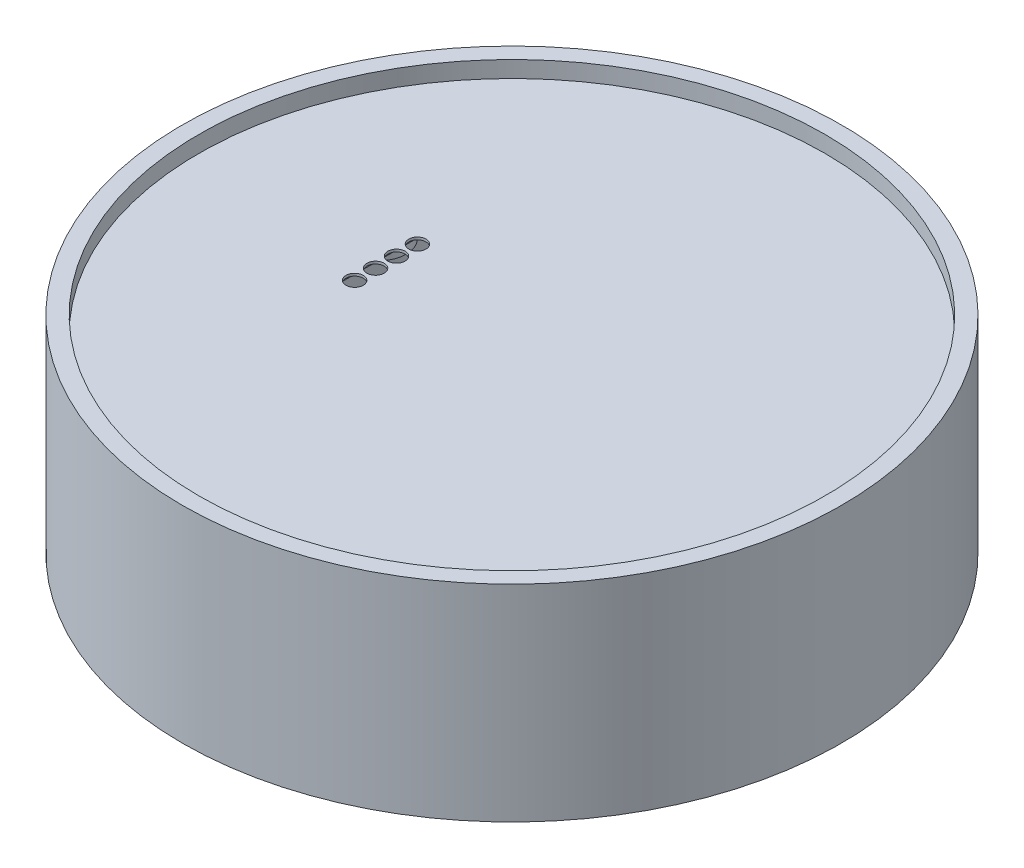
ISO-10303-21;
HEADER;
FILE_DESCRIPTION(('STEP AP214'),'2;1');
FILE_NAME('part.step','',(''),(''),'','','');
FILE_SCHEMA(('AUTOMOTIVE_DESIGN { 1 0 10303 214 1 1 1 1 }'));
ENDSEC;
DATA;
#1=APPLICATION_CONTEXT('core data for automotive mechanical design processes');
#2=APPLICATION_PROTOCOL_DEFINITION('international standard','automotive_design',2000,#1);
#3=PRODUCT_CONTEXT('',#1,'mechanical');
#4=PRODUCT('Part','Part','',(#3));
#5=PRODUCT_RELATED_PRODUCT_CATEGORY('part','',(#4));
#6=PRODUCT_DEFINITION_FORMATION('','',#4);
#7=PRODUCT_DEFINITION_CONTEXT('part definition',#1,'design');
#8=PRODUCT_DEFINITION('design','',#6,#7);
#9=PRODUCT_DEFINITION_SHAPE('','',#8);
#10=(LENGTH_UNIT() NAMED_UNIT(*) SI_UNIT(.MILLI.,.METRE.));
#11=(NAMED_UNIT(*) PLANE_ANGLE_UNIT() SI_UNIT($,.RADIAN.));
#12=(NAMED_UNIT(*) SI_UNIT($,.STERADIAN.) SOLID_ANGLE_UNIT());
#13=UNCERTAINTY_MEASURE_WITH_UNIT(LENGTH_MEASURE(1.E-05),#10,'distance_accuracy_value','');
#14=(GEOMETRIC_REPRESENTATION_CONTEXT(3) GLOBAL_UNCERTAINTY_ASSIGNED_CONTEXT((#13)) GLOBAL_UNIT_ASSIGNED_CONTEXT((#10,
#11,#12)) REPRESENTATION_CONTEXT('',''));
#15=CARTESIAN_POINT('',(0.,0.,0.));
#16=DIRECTION('',(0.,0.,1.));
#17=DIRECTION('',(1.,0.,0.));
#18=AXIS2_PLACEMENT_3D('',#15,#16,#17);
#19=CARTESIAN_POINT('',(0.,-25.,0.));
#20=DIRECTION('',(0.,1.,0.));
#21=DIRECTION('',(0.,0.,1.));
#22=AXIS2_PLACEMENT_3D('',#19,#20,#21);
#23=CYLINDRICAL_SURFACE('',#22,40.);
#24=CARTESIAN_POINT('',(0.,-19.7,0.));
#25=DIRECTION('',(0.,-1.,0.));
#26=DIRECTION('',(0.,0.,-1.));
#27=AXIS2_PLACEMENT_3D('',#24,#25,#26);
#28=CIRCLE('',#27,40.);
#29=CARTESIAN_POINT('',(-39.5087015731978,-19.7,-6.25));
#30=VERTEX_POINT('',#29);
#31=CARTESIAN_POINT('',(-39.5087015731978,-19.7,6.25));
#32=VERTEX_POINT('',#31);
#33=EDGE_CURVE('E164',#30,#32,#28,.F.);
#34=ORIENTED_EDGE('',*,*,#33,.F.);
#35=DIRECTION('',(0.,1.,0.));
#36=VECTOR('',#35,1.);
#37=CARTESIAN_POINT('',(-39.5087015731978,-25.,-6.25));
#38=LINE('',#37,#36);
#39=CARTESIAN_POINT('',(-39.5087015731978,-8.20000000000001,-6.25));
#40=VERTEX_POINT('',#39);
#41=EDGE_CURVE('E173',#40,#30,#38,.F.);
#42=ORIENTED_EDGE('',*,*,#41,.F.);
#43=CARTESIAN_POINT('',(0.,-8.20000000000001,0.));
#44=DIRECTION('',(0.,1.,0.));
#45=DIRECTION('',(0.,0.,1.));
#46=AXIS2_PLACEMENT_3D('',#43,#44,#45);
#47=CIRCLE('',#46,40.);
#48=CARTESIAN_POINT('',(-39.5087015731978,-8.20000000000001,6.25));
#49=VERTEX_POINT('',#48);
#50=EDGE_CURVE('E175',#49,#40,#47,.F.);
#51=ORIENTED_EDGE('',*,*,#50,.F.);
#52=DIRECTION('',(0.,1.,0.));
#53=VECTOR('',#52,1.);
#54=CARTESIAN_POINT('',(-39.5087015731978,-25.,6.25));
#55=LINE('',#54,#53);
#56=EDGE_CURVE('E177',#32,#49,#55,.T.);
#57=ORIENTED_EDGE('',*,*,#56,.F.);
#58=EDGE_LOOP('',(#34,#42,#51,#57));
#59=FACE_BOUND('',#58,.T.);
#60=CARTESIAN_POINT('',(0.,-25.,0.));
#61=DIRECTION('',(0.,1.,0.));
#62=DIRECTION('',(0.,0.,1.));
#63=AXIS2_PLACEMENT_3D('',#60,#61,#62);
#64=CIRCLE('',#63,40.);
#65=CARTESIAN_POINT('',(0.,-25.,40.));
#66=VERTEX_POINT('',#65);
#67=EDGE_CURVE('E192',#66,#66,#64,.T.);
#68=ORIENTED_EDGE('',*,*,#67,.T.);
#69=EDGE_LOOP('',(#68));
#70=FACE_BOUND('',#69,.T.);
#71=CARTESIAN_POINT('',(0.,0.,0.));
#72=DIRECTION('',(0.,1.,0.));
#73=DIRECTION('',(0.,0.,1.));
#74=AXIS2_PLACEMENT_3D('',#71,#72,#73);
#75=CIRCLE('',#74,40.);
#76=CARTESIAN_POINT('',(0.,0.,40.));
#77=VERTEX_POINT('',#76);
#78=EDGE_CURVE('E189',#77,#77,#75,.T.);
#79=ORIENTED_EDGE('',*,*,#78,.F.);
#80=EDGE_LOOP('',(#79));
#81=FACE_BOUND('',#80,.T.);
#82=ADVANCED_FACE('F35',(#59,#70,#81),#23,.T.);
#83=CARTESIAN_POINT('',(0.,-25.,0.));
#84=DIRECTION('',(0.,1.,0.));
#85=DIRECTION('',(0.,0.,1.));
#86=AXIS2_PLACEMENT_3D('',#83,#84,#85);
#87=PLANE('',#86);
#88=CARTESIAN_POINT('',(0.,-25.,0.));
#89=DIRECTION('',(0.,-1.,0.));
#90=DIRECTION('',(0.,0.,-1.));
#91=AXIS2_PLACEMENT_3D('',#88,#89,#90);
#92=CIRCLE('',#91,37.);
#93=CARTESIAN_POINT('',(0.,-25.,-37.));
#94=VERTEX_POINT('',#93);
#95=EDGE_CURVE('E179',#94,#94,#92,.T.);
#96=ORIENTED_EDGE('',*,*,#95,.F.);
#97=EDGE_LOOP('',(#96));
#98=FACE_BOUND('',#97,.T.);
#99=ORIENTED_EDGE('',*,*,#67,.F.);
#100=EDGE_LOOP('',(#99));
#101=FACE_BOUND('',#100,.T.);
#102=ADVANCED_FACE('F244',(#98,#101),#87,.F.);
#103=CARTESIAN_POINT('',(0.,0.,0.));
#104=DIRECTION('',(0.,1.,0.));
#105=DIRECTION('',(0.,0.,1.));
#106=AXIS2_PLACEMENT_3D('',#103,#104,#105);
#107=PLANE('',#106);
#108=CARTESIAN_POINT('',(0.,0.,0.));
#109=DIRECTION('',(0.,1.,0.));
#110=DIRECTION('',(0.,0.,1.));
#111=AXIS2_PLACEMENT_3D('',#108,#109,#110);
#112=CIRCLE('',#111,38.);
#113=CARTESIAN_POINT('',(0.,0.,38.));
#114=VERTEX_POINT('',#113);
#115=EDGE_CURVE('E185',#114,#114,#112,.T.);
#116=ORIENTED_EDGE('',*,*,#115,.F.);
#117=EDGE_LOOP('',(#116));
#118=FACE_BOUND('',#117,.T.);
#119=ORIENTED_EDGE('',*,*,#78,.T.);
#120=EDGE_LOOP('',(#119));
#121=FACE_BOUND('',#120,.T.);
#122=ADVANCED_FACE('F250',(#118,#121),#107,.T.);
#123=CARTESIAN_POINT('',(0.,-2.,0.));
#124=DIRECTION('',(0.,1.,0.));
#125=DIRECTION('',(0.,0.,1.));
#126=AXIS2_PLACEMENT_3D('',#123,#124,#125);
#127=CYLINDRICAL_SURFACE('',#126,38.);
#128=CARTESIAN_POINT('',(0.,-2.,0.));
#129=DIRECTION('',(0.,1.,0.));
#130=DIRECTION('',(0.,0.,1.));
#131=AXIS2_PLACEMENT_3D('',#128,#129,#130);
#132=CIRCLE('',#131,38.);
#133=CARTESIAN_POINT('',(0.,-2.,38.));
#134=VERTEX_POINT('',#133);
#135=EDGE_CURVE('E186',#134,#134,#132,.T.);
#136=ORIENTED_EDGE('',*,*,#135,.F.);
#137=EDGE_LOOP('',(#136));
#138=FACE_BOUND('',#137,.T.);
#139=ORIENTED_EDGE('',*,*,#115,.T.);
#140=EDGE_LOOP('',(#139));
#141=FACE_BOUND('',#140,.T.);
#142=ADVANCED_FACE('F354',(#138,#141),#127,.F.);
#143=CARTESIAN_POINT('',(0.,-2.,0.));
#144=DIRECTION('',(0.,1.,0.));
#145=DIRECTION('',(0.,0.,1.));
#146=AXIS2_PLACEMENT_3D('',#143,#144,#145);
#147=PLANE('',#146);
#148=CARTESIAN_POINT('',(-15.2035304330875,-2.,3.88729098877897));
#149=DIRECTION('',(0.,1.,0.));
#150=DIRECTION('',(0.,0.,1.));
#151=AXIS2_PLACEMENT_3D('',#148,#149,#150);
#152=CIRCLE('',#151,1.05);
#153=CARTESIAN_POINT('',(-15.2035304330875,-2.,4.93729098877897));
#154=VERTEX_POINT('',#153);
#155=EDGE_CURVE('E149',#154,#154,#152,.T.);
#156=ORIENTED_EDGE('',*,*,#155,.F.);
#157=EDGE_LOOP('',(#156));
#158=FACE_BOUND('',#157,.T.);
#159=CARTESIAN_POINT('',(-15.2035304330875,-2.,1.34729098877897));
#160=DIRECTION('',(0.,1.,0.));
#161=DIRECTION('',(0.,0.,1.));
#162=AXIS2_PLACEMENT_3D('',#159,#160,#161);
#163=CIRCLE('',#162,1.05);
#164=CARTESIAN_POINT('',(-15.2035304330875,-2.,2.39729098877897));
#165=VERTEX_POINT('',#164);
#166=EDGE_CURVE('E152',#165,#165,#163,.T.);
#167=ORIENTED_EDGE('',*,*,#166,.F.);
#168=EDGE_LOOP('',(#167));
#169=FACE_BOUND('',#168,.T.);
#170=CARTESIAN_POINT('',(-15.2035304330876,-2.,-1.19270901122103));
#171=DIRECTION('',(0.,1.,0.));
#172=DIRECTION('',(0.,0.,1.));
#173=AXIS2_PLACEMENT_3D('',#170,#171,#172);
#174=CIRCLE('',#173,1.05);
#175=CARTESIAN_POINT('',(-15.2035304330876,-2.,-0.142709011221032));
#176=VERTEX_POINT('',#175);
#177=EDGE_CURVE('E155',#176,#176,#174,.T.);
#178=ORIENTED_EDGE('',*,*,#177,.F.);
#179=EDGE_LOOP('',(#178));
#180=FACE_BOUND('',#179,.T.);
#181=CARTESIAN_POINT('',(-15.2035304330876,-2.,-3.73270901122103));
#182=DIRECTION('',(0.,1.,0.));
#183=DIRECTION('',(0.,0.,1.));
#184=AXIS2_PLACEMENT_3D('',#181,#182,#183);
#185=CIRCLE('',#184,1.05);
#186=CARTESIAN_POINT('',(-15.2035304330876,-2.,-2.68270901122103));
#187=VERTEX_POINT('',#186);
#188=EDGE_CURVE('E158',#187,#187,#185,.T.);
#189=ORIENTED_EDGE('',*,*,#188,.F.);
#190=EDGE_LOOP('',(#189));
#191=FACE_BOUND('',#190,.T.);
#192=ORIENTED_EDGE('',*,*,#135,.T.);
#193=EDGE_LOOP('',(#192));
#194=FACE_BOUND('',#193,.T.);
#195=ADVANCED_FACE('F350',(#158,#169,#180,#191,#194),#147,.T.);
#196=CARTESIAN_POINT('',(0.,-3.5,0.));
#197=DIRECTION('',(0.,1.,0.));
#198=DIRECTION('',(0.,0.,1.));
#199=AXIS2_PLACEMENT_3D('',#196,#197,#198);
#200=PLANE('',#199);
#201=CARTESIAN_POINT('',(0.,-3.5,0.));
#202=DIRECTION('',(0.,1.,0.));
#203=DIRECTION('',(0.,0.,1.));
#204=AXIS2_PLACEMENT_3D('',#201,#202,#203);
#205=CIRCLE('',#204,12.);
#206=CARTESIAN_POINT('',(0.,-3.5,12.));
#207=VERTEX_POINT('',#206);
#208=EDGE_CURVE('E12',#207,#207,#205,.T.);
#209=ORIENTED_EDGE('',*,*,#208,.T.);
#210=EDGE_LOOP('',(#209));
#211=FACE_BOUND('',#210,.T.);
#212=CARTESIAN_POINT('',(0.,-3.5,-25.));
#213=DIRECTION('',(0.,1.,0.));
#214=DIRECTION('',(0.,0.,1.));
#215=AXIS2_PLACEMENT_3D('',#212,#213,#214);
#216=CIRCLE('',#215,4.75);
#217=CARTESIAN_POINT('',(0.,-3.5,-20.25));
#218=VERTEX_POINT('',#217);
#219=EDGE_CURVE('E223',#218,#218,#216,.F.);
#220=ORIENTED_EDGE('',*,*,#219,.F.);
#221=EDGE_LOOP('',(#220));
#222=FACE_BOUND('',#221,.T.);
#223=CARTESIAN_POINT('',(0.,-3.5,25.));
#224=DIRECTION('',(0.,1.,0.));
#225=DIRECTION('',(0.,0.,1.));
#226=AXIS2_PLACEMENT_3D('',#223,#224,#225);
#227=CIRCLE('',#226,4.75);
#228=CARTESIAN_POINT('',(0.,-3.5,29.75));
#229=VERTEX_POINT('',#228);
#230=EDGE_CURVE('E220',#229,#229,#227,.F.);
#231=ORIENTED_EDGE('',*,*,#230,.F.);
#232=EDGE_LOOP('',(#231));
#233=FACE_BOUND('',#232,.T.);
#234=CARTESIAN_POINT('',(-22.1439810647103,-3.5,6.93819701810031));
#235=DIRECTION('',(0.,1.,0.));
#236=DIRECTION('',(0.,0.,1.));
#237=AXIS2_PLACEMENT_3D('',#234,#235,#236);
#238=CIRCLE('',#237,4.3);
#239=CARTESIAN_POINT('',(-22.1439810647103,-3.5,11.2381970181003));
#240=VERTEX_POINT('',#239);
#241=EDGE_CURVE('E217',#240,#240,#238,.T.);
#242=ORIENTED_EDGE('',*,*,#241,.T.);
#243=EDGE_LOOP('',(#242));
#244=FACE_BOUND('',#243,.T.);
#245=CARTESIAN_POINT('',(-22.4162086300096,-3.5,-6.28444624916386));
#246=DIRECTION('',(0.,1.,0.));
#247=DIRECTION('',(0.,0.,1.));
#248=AXIS2_PLACEMENT_3D('',#245,#246,#247);
#249=CIRCLE('',#248,3.3);
#250=CARTESIAN_POINT('',(-22.4162086300096,-3.5,-2.98444624916386));
#251=VERTEX_POINT('',#250);
#252=EDGE_CURVE('E209',#251,#251,#249,.F.);
#253=ORIENTED_EDGE('',*,*,#252,.F.);
#254=EDGE_LOOP('',(#253));
#255=FACE_BOUND('',#254,.T.);
#256=DIRECTION('',(0.,0.,-1.));
#257=VECTOR('',#256,1.);
#258=CARTESIAN_POINT('',(-17.3294977304524,-3.5,-7.79534910437546));
#259=LINE('',#258,#257);
#260=CARTESIAN_POINT('',(-17.3294977304524,-3.5,7.9499310819334));
#261=VERTEX_POINT('',#260);
#262=CARTESIAN_POINT('',(-17.3294977304524,-3.5,-7.79534910437546));
#263=VERTEX_POINT('',#262);
#264=EDGE_CURVE('E125',#261,#263,#259,.T.);
#265=ORIENTED_EDGE('',*,*,#264,.F.);
#266=DIRECTION('',(-1.,0.,0.));
#267=VECTOR('',#266,1.);
#268=CARTESIAN_POINT('',(-17.3294977304524,-3.5,7.9499310819334));
#269=LINE('',#268,#267);
#270=CARTESIAN_POINT('',(-13.0775631357227,-3.5,7.9499310819334));
#271=VERTEX_POINT('',#270);
#272=EDGE_CURVE('E117',#271,#261,#269,.T.);
#273=ORIENTED_EDGE('',*,*,#272,.F.);
#274=DIRECTION('',(0.,0.,1.));
#275=VECTOR('',#274,1.);
#276=CARTESIAN_POINT('',(-13.0775631357227,-3.5,-7.79534910437546));
#277=LINE('',#276,#275);
#278=CARTESIAN_POINT('',(-13.0775631357227,-3.5,-7.79534910437546));
#279=VERTEX_POINT('',#278);
#280=EDGE_CURVE('E129',#279,#271,#277,.T.);
#281=ORIENTED_EDGE('',*,*,#280,.F.);
#282=DIRECTION('',(1.,0.,0.));
#283=VECTOR('',#282,1.);
#284=CARTESIAN_POINT('',(-17.3294977304524,-3.5,-7.79534910437546));
#285=LINE('',#284,#283);
#286=EDGE_CURVE('E50',#263,#279,#285,.T.);
#287=ORIENTED_EDGE('',*,*,#286,.F.);
#288=EDGE_LOOP('',(#265,#273,#281,#287));
#289=FACE_BOUND('',#288,.T.);
#290=CARTESIAN_POINT('',(0.,-3.5,0.));
#291=DIRECTION('',(0.,1.,0.));
#292=DIRECTION('',(0.,0.,1.));
#293=AXIS2_PLACEMENT_3D('',#290,#291,#292);
#294=CIRCLE('',#293,37.);
#295=CARTESIAN_POINT('',(0.,-3.5,37.));
#296=VERTEX_POINT('',#295);
#297=EDGE_CURVE('E182',#296,#296,#294,.F.);
#298=ORIENTED_EDGE('',*,*,#297,.T.);
#299=EDGE_LOOP('',(#298));
#300=FACE_BOUND('',#299,.T.);
#301=ADVANCED_FACE('F241',(#211,#222,#233,#244,#255,#289,#300),#200,.F.);
#302=CARTESIAN_POINT('',(0.,102.651803615609,0.));
#303=DIRECTION('',(0.,-1.,0.));
#304=DIRECTION('',(0.,0.,-1.));
#305=AXIS2_PLACEMENT_3D('',#302,#303,#304);
#306=CYLINDRICAL_SURFACE('',#305,37.);
#307=CARTESIAN_POINT('',(0.,-19.7,0.));
#308=DIRECTION('',(0.,-1.,0.));
#309=DIRECTION('',(0.,0.,-1.));
#310=AXIS2_PLACEMENT_3D('',#307,#308,#309);
#311=CIRCLE('',#310,37.);
#312=CARTESIAN_POINT('',(-36.4683081592771,-19.7,-6.25));
#313=VERTEX_POINT('',#312);
#314=CARTESIAN_POINT('',(-36.4683081592771,-19.7,6.25));
#315=VERTEX_POINT('',#314);
#316=EDGE_CURVE('E195',#313,#315,#311,.F.);
#317=ORIENTED_EDGE('',*,*,#316,.T.);
#318=DIRECTION('',(0.,-1.,0.));
#319=VECTOR('',#318,1.);
#320=CARTESIAN_POINT('',(-36.4683081592771,102.651803615609,6.25));
#321=LINE('',#320,#319);
#322=CARTESIAN_POINT('',(-36.4683081592771,-8.20000000000002,6.25));
#323=VERTEX_POINT('',#322);
#324=EDGE_CURVE('E206',#315,#323,#321,.F.);
#325=ORIENTED_EDGE('',*,*,#324,.T.);
#326=CARTESIAN_POINT('',(0.,-8.20000000000001,0.));
#327=DIRECTION('',(0.,1.,0.));
#328=DIRECTION('',(0.,0.,1.));
#329=AXIS2_PLACEMENT_3D('',#326,#327,#328);
#330=CIRCLE('',#329,37.);
#331=CARTESIAN_POINT('',(-36.4683081592771,-8.20000000000001,-6.25));
#332=VERTEX_POINT('',#331);
#333=EDGE_CURVE('E203',#323,#332,#330,.F.);
#334=ORIENTED_EDGE('',*,*,#333,.T.);
#335=DIRECTION('',(0.,-1.,0.));
#336=VECTOR('',#335,1.);
#337=CARTESIAN_POINT('',(-36.4683081592771,102.651803615609,-6.24999999999997));
#338=LINE('',#337,#336);
#339=EDGE_CURVE('E200',#332,#313,#338,.T.);
#340=ORIENTED_EDGE('',*,*,#339,.T.);
#341=EDGE_LOOP('',(#317,#325,#334,#340));
#342=FACE_BOUND('',#341,.T.);
#343=ORIENTED_EDGE('',*,*,#95,.T.);
#344=EDGE_LOOP('',(#343));
#345=FACE_BOUND('',#344,.T.);
#346=ORIENTED_EDGE('',*,*,#297,.F.);
#347=EDGE_LOOP('',(#346));
#348=FACE_BOUND('',#347,.T.);
#349=ADVANCED_FACE('F344',(#342,#345,#348),#306,.F.);
#350=CARTESIAN_POINT('',(-40.,-8.20000000000001,6.25));
#351=DIRECTION('',(0.,0.,1.));
#352=DIRECTION('',(1.,0.,0.));
#353=AXIS2_PLACEMENT_3D('',#350,#351,#352);
#354=PLANE('',#353);
#355=ORIENTED_EDGE('',*,*,#56,.T.);
#356=DIRECTION('',(1.,0.,0.));
#357=VECTOR('',#356,1.);
#358=CARTESIAN_POINT('',(-40.,-8.20000000000001,6.25));
#359=LINE('',#358,#357);
#360=EDGE_CURVE('E161',#49,#323,#359,.T.);
#361=ORIENTED_EDGE('',*,*,#360,.T.);
#362=ORIENTED_EDGE('',*,*,#324,.F.);
#363=DIRECTION('',(1.,0.,0.));
#364=VECTOR('',#363,1.);
#365=CARTESIAN_POINT('',(-40.,-19.7,6.25));
#366=LINE('',#365,#364);
#367=EDGE_CURVE('E58',#32,#315,#366,.T.);
#368=ORIENTED_EDGE('',*,*,#367,.F.);
#369=EDGE_LOOP('',(#355,#361,#362,#368));
#370=FACE_BOUND('',#369,.T.);
#371=ADVANCED_FACE('F335',(#370),#354,.F.);
#372=CARTESIAN_POINT('',(-40.,-8.20000000000001,-6.25));
#373=DIRECTION('',(0.,1.,0.));
#374=DIRECTION('',(0.,0.,1.));
#375=AXIS2_PLACEMENT_3D('',#372,#373,#374);
#376=PLANE('',#375);
#377=ORIENTED_EDGE('',*,*,#50,.T.);
#378=DIRECTION('',(1.,0.,0.));
#379=VECTOR('',#378,1.);
#380=CARTESIAN_POINT('',(-40.,-8.20000000000001,-6.25));
#381=LINE('',#380,#379);
#382=EDGE_CURVE('E165',#40,#332,#381,.T.);
#383=ORIENTED_EDGE('',*,*,#382,.T.);
#384=ORIENTED_EDGE('',*,*,#333,.F.);
#385=ORIENTED_EDGE('',*,*,#360,.F.);
#386=EDGE_LOOP('',(#377,#383,#384,#385));
#387=FACE_BOUND('',#386,.T.);
#388=ADVANCED_FACE('F331',(#387),#376,.F.);
#389=CARTESIAN_POINT('',(-40.,-8.20000000000001,-6.25));
#390=DIRECTION('',(0.,0.,-1.));
#391=DIRECTION('',(0.,1.,0.));
#392=AXIS2_PLACEMENT_3D('',#389,#390,#391);
#393=PLANE('',#392);
#394=ORIENTED_EDGE('',*,*,#41,.T.);
#395=DIRECTION('',(1.,0.,0.));
#396=VECTOR('',#395,1.);
#397=CARTESIAN_POINT('',(-40.,-19.7,-6.25));
#398=LINE('',#397,#396);
#399=EDGE_CURVE('E168',#30,#313,#398,.T.);
#400=ORIENTED_EDGE('',*,*,#399,.T.);
#401=ORIENTED_EDGE('',*,*,#339,.F.);
#402=ORIENTED_EDGE('',*,*,#382,.F.);
#403=EDGE_LOOP('',(#394,#400,#401,#402));
#404=FACE_BOUND('',#403,.T.);
#405=ADVANCED_FACE('F334',(#404),#393,.F.);
#406=CARTESIAN_POINT('',(-40.,-19.7,-6.25));
#407=DIRECTION('',(0.,-1.,0.));
#408=DIRECTION('',(0.,0.,-1.));
#409=AXIS2_PLACEMENT_3D('',#406,#407,#408);
#410=PLANE('',#409);
#411=ORIENTED_EDGE('',*,*,#33,.T.);
#412=ORIENTED_EDGE('',*,*,#367,.T.);
#413=ORIENTED_EDGE('',*,*,#316,.F.);
#414=ORIENTED_EDGE('',*,*,#399,.F.);
#415=EDGE_LOOP('',(#411,#412,#413,#414));
#416=FACE_BOUND('',#415,.T.);
#417=ADVANCED_FACE('F329',(#416),#410,.F.);
#418=CARTESIAN_POINT('',(-15.2035304330876,-25.,-3.73270901122103));
#419=DIRECTION('',(0.,1.,0.));
#420=DIRECTION('',(0.,0.,1.));
#421=AXIS2_PLACEMENT_3D('',#418,#419,#420);
#422=CYLINDRICAL_SURFACE('',#421,1.05);
#423=CARTESIAN_POINT('',(-15.2035304330876,-2.3,-3.73270901122103));
#424=DIRECTION('',(0.,1.,0.));
#425=DIRECTION('',(0.,0.,1.));
#426=AXIS2_PLACEMENT_3D('',#423,#424,#425);
#427=CIRCLE('',#426,1.05);
#428=CARTESIAN_POINT('',(-15.2035304330876,-2.3,-2.68270901122103));
#429=VERTEX_POINT('',#428);
#430=EDGE_CURVE('E146',#429,#429,#427,.F.);
#431=ORIENTED_EDGE('',*,*,#430,.T.);
#432=EDGE_LOOP('',(#431));
#433=FACE_BOUND('',#432,.T.);
#434=ORIENTED_EDGE('',*,*,#188,.T.);
#435=EDGE_LOOP('',(#434));
#436=FACE_BOUND('',#435,.T.);
#437=ADVANCED_FACE('F325',(#433,#436),#422,.F.);
#438=CARTESIAN_POINT('',(-15.2035304330876,-25.,-1.19270901122103));
#439=DIRECTION('',(0.,1.,0.));
#440=DIRECTION('',(0.,0.,1.));
#441=AXIS2_PLACEMENT_3D('',#438,#439,#440);
#442=CYLINDRICAL_SURFACE('',#441,1.05);
#443=CARTESIAN_POINT('',(-15.2035304330876,-2.3,-1.19270901122103));
#444=DIRECTION('',(0.,1.,0.));
#445=DIRECTION('',(0.,0.,1.));
#446=AXIS2_PLACEMENT_3D('',#443,#444,#445);
#447=CIRCLE('',#446,1.05);
#448=CARTESIAN_POINT('',(-15.2035304330876,-2.3,-0.142709011221032));
#449=VERTEX_POINT('',#448);
#450=EDGE_CURVE('E143',#449,#449,#447,.F.);
#451=ORIENTED_EDGE('',*,*,#450,.T.);
#452=EDGE_LOOP('',(#451));
#453=FACE_BOUND('',#452,.T.);
#454=ORIENTED_EDGE('',*,*,#177,.T.);
#455=EDGE_LOOP('',(#454));
#456=FACE_BOUND('',#455,.T.);
#457=ADVANCED_FACE('F321',(#453,#456),#442,.F.);
#458=CARTESIAN_POINT('',(-15.2035304330875,-25.,1.34729098877897));
#459=DIRECTION('',(0.,1.,0.));
#460=DIRECTION('',(0.,0.,1.));
#461=AXIS2_PLACEMENT_3D('',#458,#459,#460);
#462=CYLINDRICAL_SURFACE('',#461,1.05);
#463=CARTESIAN_POINT('',(-15.2035304330875,-2.3,1.34729098877897));
#464=DIRECTION('',(0.,1.,0.));
#465=DIRECTION('',(0.,0.,1.));
#466=AXIS2_PLACEMENT_3D('',#463,#464,#465);
#467=CIRCLE('',#466,1.05);
#468=CARTESIAN_POINT('',(-15.2035304330875,-2.3,2.39729098877897));
#469=VERTEX_POINT('',#468);
#470=EDGE_CURVE('E140',#469,#469,#467,.F.);
#471=ORIENTED_EDGE('',*,*,#470,.T.);
#472=EDGE_LOOP('',(#471));
#473=FACE_BOUND('',#472,.T.);
#474=ORIENTED_EDGE('',*,*,#166,.T.);
#475=EDGE_LOOP('',(#474));
#476=FACE_BOUND('',#475,.T.);
#477=ADVANCED_FACE('F317',(#473,#476),#462,.F.);
#478=CARTESIAN_POINT('',(-15.2035304330875,-25.,3.88729098877897));
#479=DIRECTION('',(0.,1.,0.));
#480=DIRECTION('',(0.,0.,1.));
#481=AXIS2_PLACEMENT_3D('',#478,#479,#480);
#482=CYLINDRICAL_SURFACE('',#481,1.05);
#483=CARTESIAN_POINT('',(-15.2035304330875,-2.3,3.88729098877897));
#484=DIRECTION('',(0.,1.,0.));
#485=DIRECTION('',(0.,0.,1.));
#486=AXIS2_PLACEMENT_3D('',#483,#484,#485);
#487=CIRCLE('',#486,1.05);
#488=CARTESIAN_POINT('',(-15.2035304330875,-2.3,4.93729098877897));
#489=VERTEX_POINT('',#488);
#490=EDGE_CURVE('E139',#489,#489,#487,.F.);
#491=ORIENTED_EDGE('',*,*,#490,.T.);
#492=EDGE_LOOP('',(#491));
#493=FACE_BOUND('',#492,.T.);
#494=ORIENTED_EDGE('',*,*,#155,.T.);
#495=EDGE_LOOP('',(#494));
#496=FACE_BOUND('',#495,.T.);
#497=ADVANCED_FACE('F313',(#493,#496),#482,.F.);
#498=CARTESIAN_POINT('',(0.,-2.3,0.));
#499=DIRECTION('',(0.,1.,0.));
#500=DIRECTION('',(0.,0.,1.));
#501=AXIS2_PLACEMENT_3D('',#498,#499,#500);
#502=PLANE('',#501);
#503=ORIENTED_EDGE('',*,*,#450,.F.);
#504=EDGE_LOOP('',(#503));
#505=FACE_BOUND('',#504,.T.);
#506=ORIENTED_EDGE('',*,*,#490,.F.);
#507=EDGE_LOOP('',(#506));
#508=FACE_BOUND('',#507,.T.);
#509=DIRECTION('',(0.,0.,1.));
#510=VECTOR('',#509,1.);
#511=CARTESIAN_POINT('',(-13.0775631357227,-2.3,-7.79534910437546));
#512=LINE('',#511,#510);
#513=CARTESIAN_POINT('',(-13.0775631357227,-2.3,-7.79534910437546));
#514=VERTEX_POINT('',#513);
#515=CARTESIAN_POINT('',(-13.0775631357227,-2.3,7.9499310819334));
#516=VERTEX_POINT('',#515);
#517=EDGE_CURVE('E122',#514,#516,#512,.T.);
#518=ORIENTED_EDGE('',*,*,#517,.T.);
#519=DIRECTION('',(-1.,0.,0.));
#520=VECTOR('',#519,1.);
#521=CARTESIAN_POINT('',(-17.3294977304524,-2.3,7.9499310819334));
#522=LINE('',#521,#520);
#523=CARTESIAN_POINT('',(-17.3294977304524,-2.3,7.9499310819334));
#524=VERTEX_POINT('',#523);
#525=EDGE_CURVE('E114',#516,#524,#522,.T.);
#526=ORIENTED_EDGE('',*,*,#525,.T.);
#527=DIRECTION('',(0.,0.,-1.));
#528=VECTOR('',#527,1.);
#529=CARTESIAN_POINT('',(-17.3294977304524,-2.3,-7.79534910437546));
#530=LINE('',#529,#528);
#531=CARTESIAN_POINT('',(-17.3294977304524,-2.3,-7.79534910437546));
#532=VERTEX_POINT('',#531);
#533=EDGE_CURVE('E101',#524,#532,#530,.T.);
#534=ORIENTED_EDGE('',*,*,#533,.T.);
#535=DIRECTION('',(1.,0.,0.));
#536=VECTOR('',#535,1.);
#537=CARTESIAN_POINT('',(-17.3294977304524,-2.3,-7.79534910437546));
#538=LINE('',#537,#536);
#539=EDGE_CURVE('E134',#532,#514,#538,.T.);
#540=ORIENTED_EDGE('',*,*,#539,.T.);
#541=EDGE_LOOP('',(#518,#526,#534,#540));
#542=FACE_BOUND('',#541,.T.);
#543=ORIENTED_EDGE('',*,*,#470,.F.);
#544=EDGE_LOOP('',(#543));
#545=FACE_BOUND('',#544,.T.);
#546=ORIENTED_EDGE('',*,*,#430,.F.);
#547=EDGE_LOOP('',(#546));
#548=FACE_BOUND('',#547,.T.);
#549=ADVANCED_FACE('F120',(#505,#508,#542,#545,#548),#502,.F.);
#550=CARTESIAN_POINT('',(-17.3294977304524,14.3092855742742,7.9499310819334));
#551=DIRECTION('',(0.,0.,1.));
#552=DIRECTION('',(1.,0.,0.));
#553=AXIS2_PLACEMENT_3D('',#550,#551,#552);
#554=PLANE('',#553);
#555=DIRECTION('',(0.,-1.,0.));
#556=VECTOR('',#555,1.);
#557=CARTESIAN_POINT('',(-13.0775631357227,14.3092855742742,7.9499310819334));
#558=LINE('',#557,#556);
#559=EDGE_CURVE('E132',#516,#271,#558,.T.);
#560=ORIENTED_EDGE('',*,*,#559,.T.);
#561=ORIENTED_EDGE('',*,*,#272,.T.);
#562=DIRECTION('',(0.,-1.,0.));
#563=VECTOR('',#562,1.);
#564=CARTESIAN_POINT('',(-17.3294977304524,14.3092855742742,7.9499310819334));
#565=LINE('',#564,#563);
#566=EDGE_CURVE('E105',#524,#261,#565,.T.);
#567=ORIENTED_EDGE('',*,*,#566,.F.);
#568=ORIENTED_EDGE('',*,*,#525,.F.);
#569=EDGE_LOOP('',(#560,#561,#567,#568));
#570=FACE_BOUND('',#569,.T.);
#571=ADVANCED_FACE('F113',(#570),#554,.F.);
#572=CARTESIAN_POINT('',(-17.3294977304524,14.3092855742742,-7.79534910437546));
#573=DIRECTION('',(-1.,0.,0.));
#574=DIRECTION('',(0.,0.,1.));
#575=AXIS2_PLACEMENT_3D('',#572,#573,#574);
#576=PLANE('',#575);
#577=ORIENTED_EDGE('',*,*,#566,.T.);
#578=ORIENTED_EDGE('',*,*,#264,.T.);
#579=DIRECTION('',(0.,-1.,0.));
#580=VECTOR('',#579,1.);
#581=CARTESIAN_POINT('',(-17.3294977304524,14.3092855742742,-7.79534910437546));
#582=LINE('',#581,#580);
#583=EDGE_CURVE('E107',#532,#263,#582,.T.);
#584=ORIENTED_EDGE('',*,*,#583,.F.);
#585=ORIENTED_EDGE('',*,*,#533,.F.);
#586=EDGE_LOOP('',(#577,#578,#584,#585));
#587=FACE_BOUND('',#586,.T.);
#588=ADVANCED_FACE('F103',(#587),#576,.F.);
#589=CARTESIAN_POINT('',(-17.3294977304524,14.3092855742742,-7.79534910437546));
#590=DIRECTION('',(0.,0.,-1.));
#591=DIRECTION('',(-1.,0.,0.));
#592=AXIS2_PLACEMENT_3D('',#589,#590,#591);
#593=PLANE('',#592);
#594=ORIENTED_EDGE('',*,*,#583,.T.);
#595=ORIENTED_EDGE('',*,*,#286,.T.);
#596=DIRECTION('',(0.,-1.,0.));
#597=VECTOR('',#596,1.);
#598=CARTESIAN_POINT('',(-13.0775631357227,14.3092855742742,-7.79534910437546));
#599=LINE('',#598,#597);
#600=EDGE_CURVE('E133',#514,#279,#599,.T.);
#601=ORIENTED_EDGE('',*,*,#600,.F.);
#602=ORIENTED_EDGE('',*,*,#539,.F.);
#603=EDGE_LOOP('',(#594,#595,#601,#602));
#604=FACE_BOUND('',#603,.T.);
#605=ADVANCED_FACE('F299',(#604),#593,.F.);
#606=CARTESIAN_POINT('',(-13.0775631357227,14.3092855742742,-7.79534910437546));
#607=DIRECTION('',(1.,0.,0.));
#608=DIRECTION('',(0.,0.,-1.));
#609=AXIS2_PLACEMENT_3D('',#606,#607,#608);
#610=PLANE('',#609);
#611=ORIENTED_EDGE('',*,*,#600,.T.);
#612=ORIENTED_EDGE('',*,*,#280,.T.);
#613=ORIENTED_EDGE('',*,*,#559,.F.);
#614=ORIENTED_EDGE('',*,*,#517,.F.);
#615=EDGE_LOOP('',(#611,#612,#613,#614));
#616=FACE_BOUND('',#615,.T.);
#617=ADVANCED_FACE('F298',(#616),#610,.F.);
#618=CARTESIAN_POINT('',(-22.1439810647103,-6.3,6.93819701810031));
#619=DIRECTION('',(0.,-1.,0.));
#620=DIRECTION('',(0.,0.,-1.));
#621=AXIS2_PLACEMENT_3D('',#618,#619,#620);
#622=PLANE('',#621);
#623=CARTESIAN_POINT('',(-22.1439810647103,-6.3,6.93819701810031));
#624=DIRECTION('',(0.,-1.,0.));
#625=DIRECTION('',(0.,0.,-1.));
#626=AXIS2_PLACEMENT_3D('',#623,#624,#625);
#627=CIRCLE('',#626,3.3);
#628=CARTESIAN_POINT('',(-22.1439810647103,-6.3,3.63819701810031));
#629=VERTEX_POINT('',#628);
#630=EDGE_CURVE('E284',#629,#629,#627,.T.);
#631=ORIENTED_EDGE('',*,*,#630,.T.);
#632=EDGE_LOOP('',(#631));
#633=FACE_BOUND('',#632,.T.);
#634=CARTESIAN_POINT('',(-22.1439810647103,-6.3,6.93819701810031));
#635=DIRECTION('',(0.,-1.,0.));
#636=DIRECTION('',(0.,0.,-1.));
#637=AXIS2_PLACEMENT_3D('',#634,#635,#636);
#638=CIRCLE('',#637,1.5);
#639=CARTESIAN_POINT('',(-22.1439810647103,-6.3,5.43819701810031));
#640=VERTEX_POINT('',#639);
#641=EDGE_CURVE('E286',#640,#640,#638,.T.);
#642=ORIENTED_EDGE('',*,*,#641,.F.);
#643=EDGE_LOOP('',(#642));
#644=FACE_BOUND('',#643,.T.);
#645=ADVANCED_FACE('F280',(#633,#644),#622,.T.);
#646=CARTESIAN_POINT('',(-22.1439810647103,-6.3,6.93819701810031));
#647=DIRECTION('',(0.,1.,0.));
#648=DIRECTION('',(0.,0.,1.));
#649=AXIS2_PLACEMENT_3D('',#646,#647,#648);
#650=CYLINDRICAL_SURFACE('',#649,3.3);
#651=CARTESIAN_POINT('',(-22.1439810647103,-4.5,6.93819701810031));
#652=DIRECTION('',(0.,1.,0.));
#653=DIRECTION('',(0.,0.,1.));
#654=AXIS2_PLACEMENT_3D('',#651,#652,#653);
#655=CIRCLE('',#654,3.3);
#656=CARTESIAN_POINT('',(-22.1439810647103,-4.5,10.2381970181003));
#657=VERTEX_POINT('',#656);
#658=EDGE_CURVE('E214',#657,#657,#655,.F.);
#659=ORIENTED_EDGE('',*,*,#658,.T.);
#660=EDGE_LOOP('',(#659));
#661=FACE_BOUND('',#660,.T.);
#662=ORIENTED_EDGE('',*,*,#630,.F.);
#663=EDGE_LOOP('',(#662));
#664=FACE_BOUND('',#663,.T.);
#665=ADVANCED_FACE('F276',(#661,#664),#650,.T.);
#666=CARTESIAN_POINT('',(-22.1439810647103,-6.3,6.93819701810031));
#667=DIRECTION('',(0.,1.,0.));
#668=DIRECTION('',(0.,0.,1.));
#669=AXIS2_PLACEMENT_3D('',#666,#667,#668);
#670=CYLINDRICAL_SURFACE('',#669,1.5);
#671=ORIENTED_EDGE('',*,*,#641,.T.);
#672=EDGE_LOOP('',(#671));
#673=FACE_BOUND('',#672,.T.);
#674=CARTESIAN_POINT('',(-22.1439810647103,-3.5,6.93819701810031));
#675=DIRECTION('',(0.,-1.,0.));
#676=DIRECTION('',(0.,0.,-1.));
#677=AXIS2_PLACEMENT_3D('',#674,#675,#676);
#678=CIRCLE('',#677,1.5);
#679=CARTESIAN_POINT('',(-22.1439810647103,-3.5,5.43819701810031));
#680=VERTEX_POINT('',#679);
#681=EDGE_CURVE('E290',#680,#680,#678,.T.);
#682=ORIENTED_EDGE('',*,*,#681,.F.);
#683=EDGE_LOOP('',(#682));
#684=FACE_BOUND('',#683,.T.);
#685=ADVANCED_FACE('F279',(#673,#684),#670,.F.);
#686=ORIENTED_EDGE('',*,*,#681,.T.);
#687=EDGE_LOOP('',(#686));
#688=FACE_BOUND('',#687,.T.);
#689=ADVANCED_FACE('F270',(#688),#200,.F.);
#690=CARTESIAN_POINT('',(-22.4162086300096,-6.3,-6.28444624916386));
#691=DIRECTION('',(0.,-1.,0.));
#692=DIRECTION('',(0.,0.,-1.));
#693=AXIS2_PLACEMENT_3D('',#690,#691,#692);
#694=PLANE('',#693);
#695=CARTESIAN_POINT('',(-22.4162086300096,-6.3,-6.28444624916386));
#696=DIRECTION('',(0.,-1.,0.));
#697=DIRECTION('',(0.,0.,-1.));
#698=AXIS2_PLACEMENT_3D('',#695,#696,#697);
#699=CIRCLE('',#698,3.3);
#700=CARTESIAN_POINT('',(-22.4162086300096,-6.3,-9.58444624916386));
#701=VERTEX_POINT('',#700);
#702=EDGE_CURVE('E692',#701,#701,#699,.T.);
#703=ORIENTED_EDGE('',*,*,#702,.T.);
#704=EDGE_LOOP('',(#703));
#705=FACE_BOUND('',#704,.T.);
#706=CARTESIAN_POINT('',(-22.4162086300096,-6.3,-6.28444624916386));
#707=DIRECTION('',(0.,-1.,0.));
#708=DIRECTION('',(0.,0.,-1.));
#709=AXIS2_PLACEMENT_3D('',#706,#707,#708);
#710=CIRCLE('',#709,1.5);
#711=CARTESIAN_POINT('',(-22.4162086300096,-6.3,-7.78444624916386));
#712=VERTEX_POINT('',#711);
#713=EDGE_CURVE('E689',#712,#712,#710,.T.);
#714=ORIENTED_EDGE('',*,*,#713,.F.);
#715=EDGE_LOOP('',(#714));
#716=FACE_BOUND('',#715,.T.);
#717=ADVANCED_FACE('F499',(#705,#716),#694,.T.);
#718=CARTESIAN_POINT('',(-22.4162086300096,-6.3,-6.28444624916386));
#719=DIRECTION('',(0.,1.,0.));
#720=DIRECTION('',(0.,0.,1.));
#721=AXIS2_PLACEMENT_3D('',#718,#719,#720);
#722=CYLINDRICAL_SURFACE('',#721,3.3);
#723=ORIENTED_EDGE('',*,*,#702,.F.);
#724=EDGE_LOOP('',(#723));
#725=FACE_BOUND('',#724,.T.);
#726=ORIENTED_EDGE('',*,*,#252,.T.);
#727=EDGE_LOOP('',(#726));
#728=FACE_BOUND('',#727,.T.);
#729=ADVANCED_FACE('F507',(#725,#728),#722,.T.);
#730=CARTESIAN_POINT('',(-22.4162086300096,-6.3,-6.28444624916386));
#731=DIRECTION('',(0.,1.,0.));
#732=DIRECTION('',(0.,0.,1.));
#733=AXIS2_PLACEMENT_3D('',#730,#731,#732);
#734=CYLINDRICAL_SURFACE('',#733,1.5);
#735=ORIENTED_EDGE('',*,*,#713,.T.);
#736=EDGE_LOOP('',(#735));
#737=FACE_BOUND('',#736,.T.);
#738=CARTESIAN_POINT('',(-22.4162086300096,-3.5,-6.28444624916386));
#739=DIRECTION('',(0.,-1.,0.));
#740=DIRECTION('',(0.,0.,-1.));
#741=AXIS2_PLACEMENT_3D('',#738,#739,#740);
#742=CIRCLE('',#741,1.5);
#743=CARTESIAN_POINT('',(-22.4162086300096,-3.5,-7.78444624916386));
#744=VERTEX_POINT('',#743);
#745=EDGE_CURVE('E688',#744,#744,#742,.T.);
#746=ORIENTED_EDGE('',*,*,#745,.F.);
#747=EDGE_LOOP('',(#746));
#748=FACE_BOUND('',#747,.T.);
#749=ADVANCED_FACE('F268',(#737,#748),#734,.F.);
#750=ORIENTED_EDGE('',*,*,#745,.T.);
#751=EDGE_LOOP('',(#750));
#752=FACE_BOUND('',#751,.T.);
#753=ADVANCED_FACE('F259',(#752),#200,.F.);
#754=CARTESIAN_POINT('',(-22.1439810647103,-4.5,6.93819701810031));
#755=DIRECTION('',(0.,1.,0.));
#756=DIRECTION('',(0.,0.,1.));
#757=AXIS2_PLACEMENT_3D('',#754,#755,#756);
#758=TOROIDAL_SURFACE('',#757,4.3,1.);
#759=ORIENTED_EDGE('',*,*,#241,.F.);
#760=EDGE_LOOP('',(#759));
#761=FACE_BOUND('',#760,.T.);
#762=ORIENTED_EDGE('',*,*,#658,.F.);
#763=EDGE_LOOP('',(#762));
#764=FACE_BOUND('',#763,.T.);
#765=ADVANCED_FACE('F256',(#761,#764),#758,.F.);
#766=CARTESIAN_POINT('',(0.,-9.9,25.));
#767=DIRECTION('',(0.,-1.,0.));
#768=DIRECTION('',(0.,0.,-1.));
#769=AXIS2_PLACEMENT_3D('',#766,#767,#768);
#770=PLANE('',#769);
#771=CARTESIAN_POINT('',(0.,-9.9,25.));
#772=DIRECTION('',(0.,-1.,0.));
#773=DIRECTION('',(0.,0.,-1.));
#774=AXIS2_PLACEMENT_3D('',#771,#772,#773);
#775=CIRCLE('',#774,4.75);
#776=CARTESIAN_POINT('',(0.,-9.9,20.25));
#777=VERTEX_POINT('',#776);
#778=EDGE_CURVE('E683',#777,#777,#775,.T.);
#779=ORIENTED_EDGE('',*,*,#778,.T.);
#780=EDGE_LOOP('',(#779));
#781=FACE_BOUND('',#780,.T.);
#782=CARTESIAN_POINT('',(0.,-9.9,25.));
#783=DIRECTION('',(0.,-1.,0.));
#784=DIRECTION('',(0.,0.,-1.));
#785=AXIS2_PLACEMENT_3D('',#782,#783,#784);
#786=CIRCLE('',#785,3.25);
#787=CARTESIAN_POINT('',(0.,-9.9,21.75));
#788=VERTEX_POINT('',#787);
#789=EDGE_CURVE('E680',#788,#788,#786,.T.);
#790=ORIENTED_EDGE('',*,*,#789,.F.);
#791=EDGE_LOOP('',(#790));
#792=FACE_BOUND('',#791,.T.);
#793=ADVANCED_FACE('F258',(#781,#792),#770,.T.);
#794=CARTESIAN_POINT('',(0.,-9.9,25.));
#795=DIRECTION('',(0.,1.,0.));
#796=DIRECTION('',(0.,0.,1.));
#797=AXIS2_PLACEMENT_3D('',#794,#795,#796);
#798=CYLINDRICAL_SURFACE('',#797,4.75);
#799=ORIENTED_EDGE('',*,*,#778,.F.);
#800=EDGE_LOOP('',(#799));
#801=FACE_BOUND('',#800,.T.);
#802=ORIENTED_EDGE('',*,*,#230,.T.);
#803=EDGE_LOOP('',(#802));
#804=FACE_BOUND('',#803,.T.);
#805=ADVANCED_FACE('F265',(#801,#804),#798,.T.);
#806=CARTESIAN_POINT('',(0.,-9.9,25.));
#807=DIRECTION('',(0.,1.,0.));
#808=DIRECTION('',(0.,0.,1.));
#809=AXIS2_PLACEMENT_3D('',#806,#807,#808);
#810=CYLINDRICAL_SURFACE('',#809,3.25);
#811=ORIENTED_EDGE('',*,*,#789,.T.);
#812=EDGE_LOOP('',(#811));
#813=FACE_BOUND('',#812,.T.);
#814=CARTESIAN_POINT('',(0.,-3.5,25.));
#815=DIRECTION('',(0.,-1.,0.));
#816=DIRECTION('',(0.,0.,-1.));
#817=AXIS2_PLACEMENT_3D('',#814,#815,#816);
#818=CIRCLE('',#817,3.25);
#819=CARTESIAN_POINT('',(0.,-3.5,21.75));
#820=VERTEX_POINT('',#819);
#821=EDGE_CURVE('E679',#820,#820,#818,.T.);
#822=ORIENTED_EDGE('',*,*,#821,.F.);
#823=EDGE_LOOP('',(#822));
#824=FACE_BOUND('',#823,.T.);
#825=ADVANCED_FACE('F557',(#813,#824),#810,.F.);
#826=ORIENTED_EDGE('',*,*,#821,.T.);
#827=EDGE_LOOP('',(#826));
#828=FACE_BOUND('',#827,.T.);
#829=ADVANCED_FACE('F271',(#828),#200,.F.);
#830=CARTESIAN_POINT('',(0.,-9.9,-25.));
#831=DIRECTION('',(0.,1.,0.));
#832=DIRECTION('',(0.,0.,1.));
#833=AXIS2_PLACEMENT_3D('',#830,#831,#832);
#834=PLANE('',#833);
#835=CARTESIAN_POINT('',(0.,-9.9,-25.));
#836=DIRECTION('',(0.,-1.,0.));
#837=DIRECTION('',(0.,0.,1.));
#838=AXIS2_PLACEMENT_3D('',#835,#836,#837);
#839=CIRCLE('',#838,4.75);
#840=CARTESIAN_POINT('',(0.,-9.9,-20.25));
#841=VERTEX_POINT('',#840);
#842=EDGE_CURVE('E674',#841,#841,#839,.T.);
#843=ORIENTED_EDGE('',*,*,#842,.T.);
#844=EDGE_LOOP('',(#843));
#845=FACE_BOUND('',#844,.T.);
#846=CARTESIAN_POINT('',(0.,-9.9,-25.));
#847=DIRECTION('',(0.,-1.,0.));
#848=DIRECTION('',(0.,0.,1.));
#849=AXIS2_PLACEMENT_3D('',#846,#847,#848);
#850=CIRCLE('',#849,3.25);
#851=CARTESIAN_POINT('',(0.,-9.9,-21.75));
#852=VERTEX_POINT('',#851);
#853=EDGE_CURVE('E671',#852,#852,#850,.T.);
#854=ORIENTED_EDGE('',*,*,#853,.F.);
#855=EDGE_LOOP('',(#854));
#856=FACE_BOUND('',#855,.T.);
#857=ADVANCED_FACE('F576',(#845,#856),#834,.F.);
#858=CARTESIAN_POINT('',(0.,-9.9,-25.));
#859=DIRECTION('',(0.,1.,0.));
#860=DIRECTION('',(0.,0.,1.));
#861=AXIS2_PLACEMENT_3D('',#858,#859,#860);
#862=CYLINDRICAL_SURFACE('',#861,4.75);
#863=ORIENTED_EDGE('',*,*,#842,.F.);
#864=EDGE_LOOP('',(#863));
#865=FACE_BOUND('',#864,.T.);
#866=ORIENTED_EDGE('',*,*,#219,.T.);
#867=EDGE_LOOP('',(#866));
#868=FACE_BOUND('',#867,.T.);
#869=ADVANCED_FACE('F584',(#865,#868),#862,.T.);
#870=CARTESIAN_POINT('',(0.,-9.9,-25.));
#871=DIRECTION('',(0.,1.,0.));
#872=DIRECTION('',(0.,0.,1.));
#873=AXIS2_PLACEMENT_3D('',#870,#871,#872);
#874=CYLINDRICAL_SURFACE('',#873,3.25);
#875=ORIENTED_EDGE('',*,*,#853,.T.);
#876=EDGE_LOOP('',(#875));
#877=FACE_BOUND('',#876,.T.);
#878=CARTESIAN_POINT('',(0.,-3.5,-25.));
#879=DIRECTION('',(0.,-1.,0.));
#880=DIRECTION('',(0.,0.,1.));
#881=AXIS2_PLACEMENT_3D('',#878,#879,#880);
#882=CIRCLE('',#881,3.25);
#883=CARTESIAN_POINT('',(0.,-3.5,-21.75));
#884=VERTEX_POINT('',#883);
#885=EDGE_CURVE('E666',#884,#884,#882,.T.);
#886=ORIENTED_EDGE('',*,*,#885,.F.);
#887=EDGE_LOOP('',(#886));
#888=FACE_BOUND('',#887,.T.);
#889=ADVANCED_FACE('F594',(#877,#888),#874,.F.);
#890=ORIENTED_EDGE('',*,*,#885,.T.);
#891=EDGE_LOOP('',(#890));
#892=FACE_BOUND('',#891,.T.);
#893=ADVANCED_FACE('F240',(#892),#200,.F.);
#894=CARTESIAN_POINT('',(0.,-47.6274169979695,0.));
#895=DIRECTION('',(0.,1.,0.));
#896=DIRECTION('',(0.,0.,1.));
#897=AXIS2_PLACEMENT_3D('',#894,#895,#896);
#898=CYLINDRICAL_SURFACE('',#897,8.);
#899=CARTESIAN_POINT('',(0.,-7.5,0.));
#900=DIRECTION('',(0.,1.,0.));
#901=DIRECTION('',(0.,0.,1.));
#902=AXIS2_PLACEMENT_3D('',#899,#900,#901);
#903=CIRCLE('',#902,8.);
#904=CARTESIAN_POINT('',(0.,-7.5,8.));
#905=VERTEX_POINT('',#904);
#906=EDGE_CURVE('E43',#905,#905,#903,.F.);
#907=ORIENTED_EDGE('',*,*,#906,.T.);
#908=EDGE_LOOP('',(#907));
#909=FACE_BOUND('',#908,.T.);
#910=CARTESIAN_POINT('',(0.,-19.,0.));
#911=DIRECTION('',(0.,1.,0.));
#912=DIRECTION('',(0.,0.,1.));
#913=AXIS2_PLACEMENT_3D('',#910,#911,#912);
#914=CIRCLE('',#913,8.);
#915=CARTESIAN_POINT('',(0.,-19.,8.));
#916=VERTEX_POINT('',#915);
#917=EDGE_CURVE('E663',#916,#916,#914,.T.);
#918=ORIENTED_EDGE('',*,*,#917,.T.);
#919=EDGE_LOOP('',(#918));
#920=FACE_BOUND('',#919,.T.);
#921=ADVANCED_FACE('F228',(#909,#920),#898,.T.);
#922=CARTESIAN_POINT('',(0.,-47.6274169979695,0.));
#923=DIRECTION('',(0.,1.,0.));
#924=DIRECTION('',(0.,0.,1.));
#925=AXIS2_PLACEMENT_3D('',#922,#923,#924);
#926=CYLINDRICAL_SURFACE('',#925,3.);
#927=CARTESIAN_POINT('',(0.,-19.,0.));
#928=DIRECTION('',(0.,1.,0.));
#929=DIRECTION('',(0.,0.,1.));
#930=AXIS2_PLACEMENT_3D('',#927,#928,#929);
#931=CIRCLE('',#930,3.);
#932=CARTESIAN_POINT('',(0.,-19.,3.));
#933=VERTEX_POINT('',#932);
#934=EDGE_CURVE('E660',#933,#933,#931,.T.);
#935=ORIENTED_EDGE('',*,*,#934,.F.);
#936=EDGE_LOOP('',(#935));
#937=FACE_BOUND('',#936,.T.);
#938=CARTESIAN_POINT('',(0.,-3.5,0.));
#939=DIRECTION('',(0.,-1.,0.));
#940=DIRECTION('',(0.,0.,-1.));
#941=AXIS2_PLACEMENT_3D('',#938,#939,#940);
#942=CIRCLE('',#941,3.);
#943=CARTESIAN_POINT('',(0.,-3.5,-3.));
#944=VERTEX_POINT('',#943);
#945=EDGE_CURVE('E664',#944,#944,#942,.T.);
#946=ORIENTED_EDGE('',*,*,#945,.F.);
#947=EDGE_LOOP('',(#946));
#948=FACE_BOUND('',#947,.T.);
#949=ADVANCED_FACE('F618',(#937,#948),#926,.F.);
#950=CARTESIAN_POINT('',(0.,-19.,0.));
#951=DIRECTION('',(0.,1.,0.));
#952=DIRECTION('',(0.,0.,1.));
#953=AXIS2_PLACEMENT_3D('',#950,#951,#952);
#954=PLANE('',#953);
#955=ORIENTED_EDGE('',*,*,#934,.T.);
#956=EDGE_LOOP('',(#955));
#957=FACE_BOUND('',#956,.T.);
#958=ORIENTED_EDGE('',*,*,#917,.F.);
#959=EDGE_LOOP('',(#958));
#960=FACE_BOUND('',#959,.T.);
#961=ADVANCED_FACE('F237',(#957,#960),#954,.F.);
#962=ORIENTED_EDGE('',*,*,#945,.T.);
#963=EDGE_LOOP('',(#962));
#964=FACE_BOUND('',#963,.T.);
#965=ADVANCED_FACE('F232',(#964),#200,.F.);
#966=CARTESIAN_POINT('',(0.,-7.5,0.));
#967=DIRECTION('',(0.,1.,0.));
#968=DIRECTION('',(0.,0.,1.));
#969=AXIS2_PLACEMENT_3D('',#966,#967,#968);
#970=TOROIDAL_SURFACE('',#969,12.,4.);
#971=ORIENTED_EDGE('',*,*,#208,.F.);
#972=EDGE_LOOP('',(#971));
#973=FACE_BOUND('',#972,.T.);
#974=ORIENTED_EDGE('',*,*,#906,.F.);
#975=EDGE_LOOP('',(#974));
#976=FACE_BOUND('',#975,.T.);
#977=ADVANCED_FACE('F37',(#973,#976),#970,.F.);
#978=CLOSED_SHELL('',(#82,#102,#122,#142,#195,#301,#349,#371,#388,#405,#417,#437,#457,#477,#497,
#549,#571,#588,#605,#617,#645,#665,#685,#689,#717,#729,#749,#753,#765,#793,#805,#825,#829,#857,
#869,#889,#893,#921,#949,#961,#965,#977));
#979=MANIFOLD_SOLID_BREP('B2',#978);
#980=ADVANCED_BREP_SHAPE_REPRESENTATION('',(#18,#979),#14);
#981=SHAPE_DEFINITION_REPRESENTATION(#9,#980);
ENDSEC;
END-ISO-10303-21;
